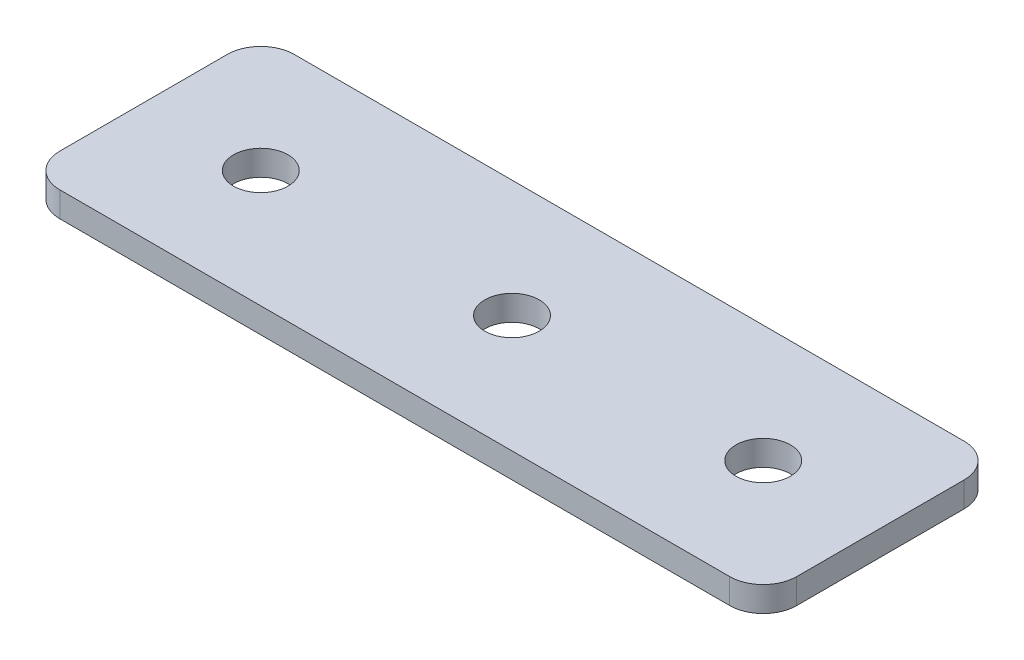
ISO-10303-21;
HEADER;
FILE_DESCRIPTION(('STEP AP214'),'2;1');
FILE_NAME('part.step','',(''),(''),'','','');
FILE_SCHEMA(('AUTOMOTIVE_DESIGN { 1 0 10303 214 1 1 1 1 }'));
ENDSEC;
DATA;
#1=APPLICATION_CONTEXT('core data for automotive mechanical design processes');
#2=APPLICATION_PROTOCOL_DEFINITION('international standard','automotive_design',2000,#1);
#3=PRODUCT_CONTEXT('',#1,'mechanical');
#4=PRODUCT('Part','Part','',(#3));
#5=PRODUCT_RELATED_PRODUCT_CATEGORY('part','',(#4));
#6=PRODUCT_DEFINITION_FORMATION('','',#4);
#7=PRODUCT_DEFINITION_CONTEXT('part definition',#1,'design');
#8=PRODUCT_DEFINITION('design','',#6,#7);
#9=PRODUCT_DEFINITION_SHAPE('','',#8);
#10=(LENGTH_UNIT() NAMED_UNIT(*) SI_UNIT(.MILLI.,.METRE.));
#11=(NAMED_UNIT(*) PLANE_ANGLE_UNIT() SI_UNIT($,.RADIAN.));
#12=(NAMED_UNIT(*) SI_UNIT($,.STERADIAN.) SOLID_ANGLE_UNIT());
#13=UNCERTAINTY_MEASURE_WITH_UNIT(LENGTH_MEASURE(1.E-05),#10,'distance_accuracy_value','');
#14=(GEOMETRIC_REPRESENTATION_CONTEXT(3) GLOBAL_UNCERTAINTY_ASSIGNED_CONTEXT((#13)) GLOBAL_UNIT_ASSIGNED_CONTEXT((#10,
#11,#12)) REPRESENTATION_CONTEXT('',''));
#15=CARTESIAN_POINT('',(0.,0.,0.));
#16=DIRECTION('',(0.,0.,1.));
#17=DIRECTION('',(1.,0.,0.));
#18=AXIS2_PLACEMENT_3D('',#15,#16,#17);
#19=CARTESIAN_POINT('',(-16.2872126789602,0.874792376219375,-0.337315644458155));
#20=DIRECTION('',(0.,-1.,0.));
#21=DIRECTION('',(0.,0.,-1.));
#22=AXIS2_PLACEMENT_3D('',#19,#20,#21);
#23=PLANE('',#22);
#24=CARTESIAN_POINT('',(13.7127873210399,0.874792376219375,-0.337315644458155));
#25=DIRECTION('',(0.,1.,0.));
#26=DIRECTION('',(0.,0.,1.));
#27=AXIS2_PLACEMENT_3D('',#24,#25,#26);
#28=CIRCLE('',#27,1.625);
#29=CARTESIAN_POINT('',(13.7127873210399,0.874792376219375,1.28768435554185));
#30=VERTEX_POINT('',#29);
#31=EDGE_CURVE('E163',#30,#30,#28,.T.);
#32=ORIENTED_EDGE('',*,*,#31,.T.);
#33=EDGE_LOOP('',(#32));
#34=FACE_BOUND('',#33,.T.);
#35=CARTESIAN_POINT('',(-1.28721267896015,0.874792376219375,-0.337315644458144));
#36=DIRECTION('',(0.,1.,0.));
#37=DIRECTION('',(0.,0.,1.));
#38=AXIS2_PLACEMENT_3D('',#35,#36,#37);
#39=CIRCLE('',#38,1.625);
#40=CARTESIAN_POINT('',(-1.28721267896015,0.874792376219375,1.28768435554186));
#41=VERTEX_POINT('',#40);
#42=EDGE_CURVE('E157',#41,#41,#39,.T.);
#43=ORIENTED_EDGE('',*,*,#42,.T.);
#44=EDGE_LOOP('',(#43));
#45=FACE_BOUND('',#44,.T.);
#46=CARTESIAN_POINT('',(-16.2872126789602,0.874792376219375,-0.337315644458155));
#47=DIRECTION('',(0.,1.,0.));
#48=DIRECTION('',(0.,0.,1.));
#49=AXIS2_PLACEMENT_3D('',#46,#47,#48);
#50=CIRCLE('',#49,1.625);
#51=CARTESIAN_POINT('',(-16.2872126789602,0.874792376219375,1.28768435554185));
#52=VERTEX_POINT('',#51);
#53=EDGE_CURVE('E103',#52,#52,#50,.T.);
#54=ORIENTED_EDGE('',*,*,#53,.T.);
#55=EDGE_LOOP('',(#54));
#56=FACE_BOUND('',#55,.T.);
#57=DIRECTION('',(0.,0.,-1.));
#58=VECTOR('',#57,1.);
#59=CARTESIAN_POINT('',(20.7127873210397,0.874792376219375,6.66268435554188));
#60=LINE('',#59,#58);
#61=CARTESIAN_POINT('',(20.7127873210397,0.874792376219375,4.66268435554188));
#62=VERTEX_POINT('',#61);
#63=CARTESIAN_POINT('',(20.7127873210397,0.874792376219375,-5.3373156444582));
#64=VERTEX_POINT('',#63);
#65=EDGE_CURVE('E150',#62,#64,#60,.T.);
#66=ORIENTED_EDGE('',*,*,#65,.F.);
#67=CARTESIAN_POINT('',(18.7127873210397,0.874792376219375,4.66268435554188));
#68=DIRECTION('',(0.,-1.,0.));
#69=DIRECTION('',(0.,0.,-1.));
#70=AXIS2_PLACEMENT_3D('',#67,#68,#69);
#71=CIRCLE('',#70,2.);
#72=CARTESIAN_POINT('',(18.7127873210397,0.874792376219375,6.66268435554188));
#73=VERTEX_POINT('',#72);
#74=EDGE_CURVE('E130',#62,#73,#71,.T.);
#75=ORIENTED_EDGE('',*,*,#74,.T.);
#76=DIRECTION('',(1.,0.,0.));
#77=VECTOR('',#76,1.);
#78=CARTESIAN_POINT('',(-9.28721267896007,0.874792376219375,6.66268435554188));
#79=LINE('',#78,#77);
#80=CARTESIAN_POINT('',(-21.2872126789603,0.874792376219375,6.66268435554188));
#81=VERTEX_POINT('',#80);
#82=EDGE_CURVE('E146',#81,#73,#79,.T.);
#83=ORIENTED_EDGE('',*,*,#82,.F.);
#84=CARTESIAN_POINT('',(-21.2872126789603,0.874792376219375,4.66268435554188));
#85=DIRECTION('',(0.,-1.,0.));
#86=DIRECTION('',(0.,0.,-1.));
#87=AXIS2_PLACEMENT_3D('',#84,#85,#86);
#88=CIRCLE('',#87,2.);
#89=CARTESIAN_POINT('',(-23.2872126789603,0.874792376219375,4.66268435554188));
#90=VERTEX_POINT('',#89);
#91=EDGE_CURVE('E106',#81,#90,#88,.T.);
#92=ORIENTED_EDGE('',*,*,#91,.T.);
#93=DIRECTION('',(0.,0.,1.));
#94=VECTOR('',#93,1.);
#95=CARTESIAN_POINT('',(-23.2872126789603,0.874792376219375,-7.33731564445819));
#96=LINE('',#95,#94);
#97=CARTESIAN_POINT('',(-23.2872126789603,0.874792376219375,-5.33731564445819));
#98=VERTEX_POINT('',#97);
#99=EDGE_CURVE('E107',#98,#90,#96,.T.);
#100=ORIENTED_EDGE('',*,*,#99,.F.);
#101=CARTESIAN_POINT('',(-21.2872126789603,0.874792376219375,-5.33731564445819));
#102=DIRECTION('',(0.,-1.,0.));
#103=DIRECTION('',(0.,0.,-1.));
#104=AXIS2_PLACEMENT_3D('',#101,#102,#103);
#105=CIRCLE('',#104,2.);
#106=CARTESIAN_POINT('',(-21.2872126789603,0.874792376219375,-7.33731564445819));
#107=VERTEX_POINT('',#106);
#108=EDGE_CURVE('E31',#98,#107,#105,.T.);
#109=ORIENTED_EDGE('',*,*,#108,.T.);
#110=DIRECTION('',(-1.,0.,0.));
#111=VECTOR('',#110,1.);
#112=CARTESIAN_POINT('',(20.7127873210397,0.874792376219375,-7.3373156444582));
#113=LINE('',#112,#111);
#114=CARTESIAN_POINT('',(18.7127873210397,0.874792376219375,-7.3373156444582));
#115=VERTEX_POINT('',#114);
#116=EDGE_CURVE('E111',#115,#107,#113,.T.);
#117=ORIENTED_EDGE('',*,*,#116,.F.);
#118=CARTESIAN_POINT('',(18.7127873210397,0.874792376219375,-5.3373156444582));
#119=DIRECTION('',(0.,-1.,0.));
#120=DIRECTION('',(0.,0.,-1.));
#121=AXIS2_PLACEMENT_3D('',#118,#119,#120);
#122=CIRCLE('',#121,2.);
#123=EDGE_CURVE('E128',#115,#64,#122,.T.);
#124=ORIENTED_EDGE('',*,*,#123,.T.);
#125=EDGE_LOOP('',(#66,#75,#83,#92,#100,#109,#117,#124));
#126=FACE_BOUND('',#125,.T.);
#127=ADVANCED_FACE('F16',(#34,#45,#56,#126),#23,.T.);
#128=CARTESIAN_POINT('',(-9.28721267896007,0.874792376219375,6.66268435554188));
#129=DIRECTION('',(0.,0.,1.));
#130=DIRECTION('',(1.,0.,0.));
#131=AXIS2_PLACEMENT_3D('',#128,#129,#130);
#132=PLANE('',#131);
#133=ORIENTED_EDGE('',*,*,#82,.T.);
#134=DIRECTION('',(0.,1.,0.));
#135=VECTOR('',#134,1.);
#136=CARTESIAN_POINT('',(18.7127873210397,0.874792376219375,6.66268435554188));
#137=LINE('',#136,#135);
#138=CARTESIAN_POINT('',(18.7127873210397,2.37479237621938,6.66268435554188));
#139=VERTEX_POINT('',#138);
#140=EDGE_CURVE('E93',#73,#139,#137,.T.);
#141=ORIENTED_EDGE('',*,*,#140,.T.);
#142=DIRECTION('',(1.,0.,0.));
#143=VECTOR('',#142,1.);
#144=CARTESIAN_POINT('',(-9.28721267896007,2.37479237621938,6.66268435554188));
#145=LINE('',#144,#143);
#146=CARTESIAN_POINT('',(-21.2872126789603,2.37479237621938,6.66268435554188));
#147=VERTEX_POINT('',#146);
#148=EDGE_CURVE('E85',#147,#139,#145,.T.);
#149=ORIENTED_EDGE('',*,*,#148,.F.);
#150=DIRECTION('',(0.,1.,0.));
#151=VECTOR('',#150,1.);
#152=CARTESIAN_POINT('',(-21.2872126789603,0.874792376219375,6.66268435554188));
#153=LINE('',#152,#151);
#154=EDGE_CURVE('E99',#147,#81,#153,.F.);
#155=ORIENTED_EDGE('',*,*,#154,.T.);
#156=EDGE_LOOP('',(#133,#141,#149,#155));
#157=FACE_BOUND('',#156,.T.);
#158=ADVANCED_FACE('F98',(#157),#132,.T.);
#159=CARTESIAN_POINT('',(-23.2872126789603,0.874792376219375,-7.33731564445819));
#160=DIRECTION('',(-1.,0.,0.));
#161=DIRECTION('',(0.,0.,1.));
#162=AXIS2_PLACEMENT_3D('',#159,#160,#161);
#163=PLANE('',#162);
#164=DIRECTION('',(0.,0.,1.));
#165=VECTOR('',#164,1.);
#166=CARTESIAN_POINT('',(-23.2872126789603,2.37479237621938,-7.33731564445819));
#167=LINE('',#166,#165);
#168=CARTESIAN_POINT('',(-23.2872126789603,2.37479237621938,-5.33731564445819));
#169=VERTEX_POINT('',#168);
#170=CARTESIAN_POINT('',(-23.2872126789603,2.37479237621938,4.66268435554188));
#171=VERTEX_POINT('',#170);
#172=EDGE_CURVE('E87',#169,#171,#167,.T.);
#173=ORIENTED_EDGE('',*,*,#172,.F.);
#174=DIRECTION('',(0.,1.,0.));
#175=VECTOR('',#174,1.);
#176=CARTESIAN_POINT('',(-23.2872126789603,0.874792376219375,-5.33731564445819));
#177=LINE('',#176,#175);
#178=EDGE_CURVE('E10',#169,#98,#177,.F.);
#179=ORIENTED_EDGE('',*,*,#178,.T.);
#180=ORIENTED_EDGE('',*,*,#99,.T.);
#181=DIRECTION('',(0.,1.,0.));
#182=VECTOR('',#181,1.);
#183=CARTESIAN_POINT('',(-23.2872126789603,0.874792376219375,4.66268435554188));
#184=LINE('',#183,#182);
#185=EDGE_CURVE('E24',#90,#171,#184,.T.);
#186=ORIENTED_EDGE('',*,*,#185,.T.);
#187=EDGE_LOOP('',(#173,#179,#180,#186));
#188=FACE_BOUND('',#187,.T.);
#189=ADVANCED_FACE('F136',(#188),#163,.T.);
#190=CARTESIAN_POINT('',(20.7127873210397,0.874792376219375,-7.3373156444582));
#191=DIRECTION('',(0.,0.,-1.));
#192=DIRECTION('',(-1.,0.,0.));
#193=AXIS2_PLACEMENT_3D('',#190,#191,#192);
#194=PLANE('',#193);
#195=DIRECTION('',(-1.,0.,0.));
#196=VECTOR('',#195,1.);
#197=CARTESIAN_POINT('',(20.7127873210397,2.37479237621938,-7.3373156444582));
#198=LINE('',#197,#196);
#199=CARTESIAN_POINT('',(18.7127873210397,2.37479237621938,-7.3373156444582));
#200=VERTEX_POINT('',#199);
#201=CARTESIAN_POINT('',(-21.2872126789603,2.37479237621938,-7.33731564445819));
#202=VERTEX_POINT('',#201);
#203=EDGE_CURVE('E144',#200,#202,#198,.T.);
#204=ORIENTED_EDGE('',*,*,#203,.F.);
#205=DIRECTION('',(0.,1.,0.));
#206=VECTOR('',#205,1.);
#207=CARTESIAN_POINT('',(18.7127873210397,0.874792376219375,-7.3373156444582));
#208=LINE('',#207,#206);
#209=EDGE_CURVE('E38',#200,#115,#208,.F.);
#210=ORIENTED_EDGE('',*,*,#209,.T.);
#211=ORIENTED_EDGE('',*,*,#116,.T.);
#212=DIRECTION('',(0.,1.,0.));
#213=VECTOR('',#212,1.);
#214=CARTESIAN_POINT('',(-21.2872126789603,0.874792376219375,-7.33731564445819));
#215=LINE('',#214,#213);
#216=EDGE_CURVE('E132',#107,#202,#215,.T.);
#217=ORIENTED_EDGE('',*,*,#216,.T.);
#218=EDGE_LOOP('',(#204,#210,#211,#217));
#219=FACE_BOUND('',#218,.T.);
#220=ADVANCED_FACE('F143',(#219),#194,.T.);
#221=CARTESIAN_POINT('',(20.7127873210397,0.874792376219375,6.66268435554188));
#222=DIRECTION('',(1.,0.,0.));
#223=DIRECTION('',(0.,0.,-1.));
#224=AXIS2_PLACEMENT_3D('',#221,#222,#223);
#225=PLANE('',#224);
#226=DIRECTION('',(0.,0.,-1.));
#227=VECTOR('',#226,1.);
#228=CARTESIAN_POINT('',(20.7127873210397,2.37479237621938,6.66268435554188));
#229=LINE('',#228,#227);
#230=CARTESIAN_POINT('',(20.7127873210397,2.37479237621938,4.66268435554188));
#231=VERTEX_POINT('',#230);
#232=CARTESIAN_POINT('',(20.7127873210397,2.37479237621938,-5.3373156444582));
#233=VERTEX_POINT('',#232);
#234=EDGE_CURVE('E102',#231,#233,#229,.T.);
#235=ORIENTED_EDGE('',*,*,#234,.F.);
#236=DIRECTION('',(0.,1.,0.));
#237=VECTOR('',#236,1.);
#238=CARTESIAN_POINT('',(20.7127873210397,0.874792376219375,4.66268435554188));
#239=LINE('',#238,#237);
#240=EDGE_CURVE('E124',#231,#62,#239,.F.);
#241=ORIENTED_EDGE('',*,*,#240,.T.);
#242=ORIENTED_EDGE('',*,*,#65,.T.);
#243=DIRECTION('',(0.,1.,0.));
#244=VECTOR('',#243,1.);
#245=CARTESIAN_POINT('',(20.7127873210397,0.874792376219375,-5.3373156444582));
#246=LINE('',#245,#244);
#247=EDGE_CURVE('E121',#64,#233,#246,.T.);
#248=ORIENTED_EDGE('',*,*,#247,.T.);
#249=EDGE_LOOP('',(#235,#241,#242,#248));
#250=FACE_BOUND('',#249,.T.);
#251=ADVANCED_FACE('F185',(#250),#225,.T.);
#252=CARTESIAN_POINT('',(-16.2872126789602,2.37479237621938,-0.337315644458155));
#253=DIRECTION('',(0.,-1.,0.));
#254=DIRECTION('',(0.,0.,-1.));
#255=AXIS2_PLACEMENT_3D('',#252,#253,#254);
#256=PLANE('',#255);
#257=CARTESIAN_POINT('',(13.7127873210399,2.37479237621938,-0.337315644458155));
#258=DIRECTION('',(0.,1.,0.));
#259=DIRECTION('',(0.,0.,1.));
#260=AXIS2_PLACEMENT_3D('',#257,#258,#259);
#261=CIRCLE('',#260,1.625);
#262=CARTESIAN_POINT('',(13.7127873210399,2.37479237621938,1.28768435554185));
#263=VERTEX_POINT('',#262);
#264=EDGE_CURVE('E166',#263,#263,#261,.T.);
#265=ORIENTED_EDGE('',*,*,#264,.F.);
#266=EDGE_LOOP('',(#265));
#267=FACE_BOUND('',#266,.T.);
#268=CARTESIAN_POINT('',(-1.28721267896015,2.37479237621938,-0.337315644458144));
#269=DIRECTION('',(0.,1.,0.));
#270=DIRECTION('',(0.,0.,1.));
#271=AXIS2_PLACEMENT_3D('',#268,#269,#270);
#272=CIRCLE('',#271,1.625);
#273=CARTESIAN_POINT('',(-1.28721267896015,2.37479237621938,1.28768435554186));
#274=VERTEX_POINT('',#273);
#275=EDGE_CURVE('E160',#274,#274,#272,.T.);
#276=ORIENTED_EDGE('',*,*,#275,.F.);
#277=EDGE_LOOP('',(#276));
#278=FACE_BOUND('',#277,.T.);
#279=CARTESIAN_POINT('',(-16.2872126789602,2.37479237621938,-0.337315644458155));
#280=DIRECTION('',(0.,1.,0.));
#281=DIRECTION('',(0.,0.,1.));
#282=AXIS2_PLACEMENT_3D('',#279,#280,#281);
#283=CIRCLE('',#282,1.625);
#284=CARTESIAN_POINT('',(-16.2872126789602,2.37479237621938,1.28768435554185));
#285=VERTEX_POINT('',#284);
#286=EDGE_CURVE('E154',#285,#285,#283,.T.);
#287=ORIENTED_EDGE('',*,*,#286,.F.);
#288=EDGE_LOOP('',(#287));
#289=FACE_BOUND('',#288,.T.);
#290=ORIENTED_EDGE('',*,*,#148,.T.);
#291=CARTESIAN_POINT('',(18.7127873210397,2.37479237621938,4.66268435554188));
#292=DIRECTION('',(0.,-1.,0.));
#293=DIRECTION('',(0.,0.,-1.));
#294=AXIS2_PLACEMENT_3D('',#291,#292,#293);
#295=CIRCLE('',#294,2.);
#296=EDGE_CURVE('E119',#139,#231,#295,.F.);
#297=ORIENTED_EDGE('',*,*,#296,.T.);
#298=ORIENTED_EDGE('',*,*,#234,.T.);
#299=CARTESIAN_POINT('',(18.7127873210397,2.37479237621938,-5.3373156444582));
#300=DIRECTION('',(0.,-1.,0.));
#301=DIRECTION('',(0.,0.,-1.));
#302=AXIS2_PLACEMENT_3D('',#299,#300,#301);
#303=CIRCLE('',#302,2.);
#304=EDGE_CURVE('E117',#233,#200,#303,.F.);
#305=ORIENTED_EDGE('',*,*,#304,.T.);
#306=ORIENTED_EDGE('',*,*,#203,.T.);
#307=CARTESIAN_POINT('',(-21.2872126789603,2.37479237621938,-5.33731564445819));
#308=DIRECTION('',(0.,-1.,0.));
#309=DIRECTION('',(0.,0.,-1.));
#310=AXIS2_PLACEMENT_3D('',#307,#308,#309);
#311=CIRCLE('',#310,2.);
#312=EDGE_CURVE('E92',#202,#169,#311,.F.);
#313=ORIENTED_EDGE('',*,*,#312,.T.);
#314=ORIENTED_EDGE('',*,*,#172,.T.);
#315=CARTESIAN_POINT('',(-21.2872126789603,2.37479237621938,4.66268435554188));
#316=DIRECTION('',(0.,-1.,0.));
#317=DIRECTION('',(0.,0.,-1.));
#318=AXIS2_PLACEMENT_3D('',#315,#316,#317);
#319=CIRCLE('',#318,2.);
#320=EDGE_CURVE('E82',#171,#147,#319,.F.);
#321=ORIENTED_EDGE('',*,*,#320,.T.);
#322=EDGE_LOOP('',(#290,#297,#298,#305,#306,#313,#314,#321));
#323=FACE_BOUND('',#322,.T.);
#324=ADVANCED_FACE('F84',(#267,#278,#289,#323),#256,.F.);
#325=CARTESIAN_POINT('',(-16.2872126789602,0.874792376219375,-0.337315644458155));
#326=DIRECTION('',(0.,1.,0.));
#327=DIRECTION('',(0.,0.,1.));
#328=AXIS2_PLACEMENT_3D('',#325,#326,#327);
#329=CYLINDRICAL_SURFACE('',#328,1.625);
#330=ORIENTED_EDGE('',*,*,#53,.F.);
#331=EDGE_LOOP('',(#330));
#332=FACE_BOUND('',#331,.T.);
#333=ORIENTED_EDGE('',*,*,#286,.T.);
#334=EDGE_LOOP('',(#333));
#335=FACE_BOUND('',#334,.T.);
#336=ADVANCED_FACE('F184',(#332,#335),#329,.F.);
#337=CARTESIAN_POINT('',(-1.28721267896015,0.874792376219375,-0.337315644458144));
#338=DIRECTION('',(0.,1.,0.));
#339=DIRECTION('',(0.,0.,1.));
#340=AXIS2_PLACEMENT_3D('',#337,#338,#339);
#341=CYLINDRICAL_SURFACE('',#340,1.625);
#342=ORIENTED_EDGE('',*,*,#42,.F.);
#343=EDGE_LOOP('',(#342));
#344=FACE_BOUND('',#343,.T.);
#345=ORIENTED_EDGE('',*,*,#275,.T.);
#346=EDGE_LOOP('',(#345));
#347=FACE_BOUND('',#346,.T.);
#348=ADVANCED_FACE('F178',(#344,#347),#341,.F.);
#349=CARTESIAN_POINT('',(13.7127873210399,0.874792376219375,-0.337315644458155));
#350=DIRECTION('',(0.,1.,0.));
#351=DIRECTION('',(0.,0.,1.));
#352=AXIS2_PLACEMENT_3D('',#349,#350,#351);
#353=CYLINDRICAL_SURFACE('',#352,1.625);
#354=ORIENTED_EDGE('',*,*,#31,.F.);
#355=EDGE_LOOP('',(#354));
#356=FACE_BOUND('',#355,.T.);
#357=ORIENTED_EDGE('',*,*,#264,.T.);
#358=EDGE_LOOP('',(#357));
#359=FACE_BOUND('',#358,.T.);
#360=ADVANCED_FACE('F174',(#356,#359),#353,.F.);
#361=CARTESIAN_POINT('',(18.7127873210397,0.874792376219375,4.66268435554188));
#362=DIRECTION('',(0.,1.,0.));
#363=DIRECTION('',(0.,0.,1.));
#364=AXIS2_PLACEMENT_3D('',#361,#362,#363);
#365=CYLINDRICAL_SURFACE('',#364,2.);
#366=ORIENTED_EDGE('',*,*,#74,.F.);
#367=ORIENTED_EDGE('',*,*,#240,.F.);
#368=ORIENTED_EDGE('',*,*,#296,.F.);
#369=ORIENTED_EDGE('',*,*,#140,.F.);
#370=EDGE_LOOP('',(#366,#367,#368,#369));
#371=FACE_BOUND('',#370,.T.);
#372=ADVANCED_FACE('F177',(#371),#365,.T.);
#373=CARTESIAN_POINT('',(18.7127873210397,0.874792376219375,-5.3373156444582));
#374=DIRECTION('',(0.,1.,0.));
#375=DIRECTION('',(0.,0.,1.));
#376=AXIS2_PLACEMENT_3D('',#373,#374,#375);
#377=CYLINDRICAL_SURFACE('',#376,2.);
#378=ORIENTED_EDGE('',*,*,#123,.F.);
#379=ORIENTED_EDGE('',*,*,#209,.F.);
#380=ORIENTED_EDGE('',*,*,#304,.F.);
#381=ORIENTED_EDGE('',*,*,#247,.F.);
#382=EDGE_LOOP('',(#378,#379,#380,#381));
#383=FACE_BOUND('',#382,.T.);
#384=ADVANCED_FACE('F211',(#383),#377,.T.);
#385=CARTESIAN_POINT('',(-21.2872126789603,0.874792376219375,-5.33731564445819));
#386=DIRECTION('',(0.,1.,0.));
#387=DIRECTION('',(0.,0.,1.));
#388=AXIS2_PLACEMENT_3D('',#385,#386,#387);
#389=CYLINDRICAL_SURFACE('',#388,2.);
#390=ORIENTED_EDGE('',*,*,#108,.F.);
#391=ORIENTED_EDGE('',*,*,#178,.F.);
#392=ORIENTED_EDGE('',*,*,#312,.F.);
#393=ORIENTED_EDGE('',*,*,#216,.F.);
#394=EDGE_LOOP('',(#390,#391,#392,#393));
#395=FACE_BOUND('',#394,.T.);
#396=ADVANCED_FACE('F141',(#395),#389,.T.);
#397=CARTESIAN_POINT('',(-21.2872126789603,0.874792376219375,4.66268435554188));
#398=DIRECTION('',(0.,1.,0.));
#399=DIRECTION('',(0.,0.,1.));
#400=AXIS2_PLACEMENT_3D('',#397,#398,#399);
#401=CYLINDRICAL_SURFACE('',#400,2.);
#402=ORIENTED_EDGE('',*,*,#91,.F.);
#403=ORIENTED_EDGE('',*,*,#154,.F.);
#404=ORIENTED_EDGE('',*,*,#320,.F.);
#405=ORIENTED_EDGE('',*,*,#185,.F.);
#406=EDGE_LOOP('',(#402,#403,#404,#405));
#407=FACE_BOUND('',#406,.T.);
#408=ADVANCED_FACE('F18',(#407),#401,.T.);
#409=CLOSED_SHELL('',(#127,#158,#189,#220,#251,#324,#336,#348,#360,#372,#384,#396,#408));
#410=MANIFOLD_SOLID_BREP('B1',#409);
#411=ADVANCED_BREP_SHAPE_REPRESENTATION('',(#18,#410),#14);
#412=SHAPE_DEFINITION_REPRESENTATION(#9,#411);
ENDSEC;
END-ISO-10303-21;
